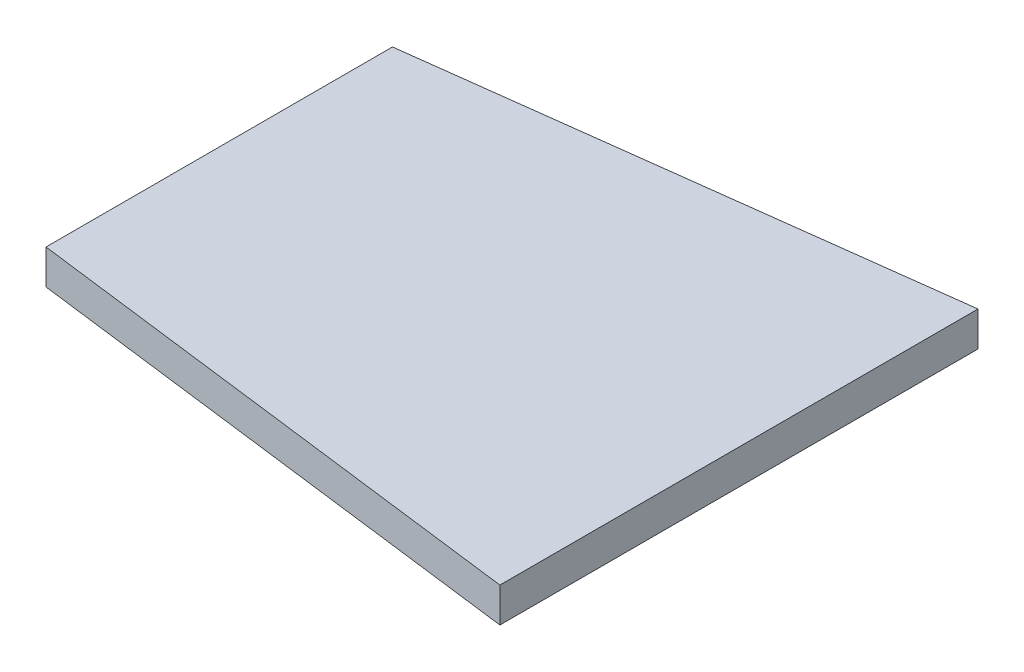
ISO-10303-21;
HEADER;
FILE_DESCRIPTION(('STEP AP214'),'2;1');
FILE_NAME('part.step','',(''),(''),'','','');
FILE_SCHEMA(('AUTOMOTIVE_DESIGN { 1 0 10303 214 1 1 1 1 }'));
ENDSEC;
DATA;
#1=APPLICATION_CONTEXT('core data for automotive mechanical design processes');
#2=APPLICATION_PROTOCOL_DEFINITION('international standard','automotive_design',2000,#1);
#3=PRODUCT_CONTEXT('',#1,'mechanical');
#4=PRODUCT('Part','Part','',(#3));
#5=PRODUCT_RELATED_PRODUCT_CATEGORY('part','',(#4));
#6=PRODUCT_DEFINITION_FORMATION('','',#4);
#7=PRODUCT_DEFINITION_CONTEXT('part definition',#1,'design');
#8=PRODUCT_DEFINITION('design','',#6,#7);
#9=PRODUCT_DEFINITION_SHAPE('','',#8);
#10=(LENGTH_UNIT() NAMED_UNIT(*) SI_UNIT(.MILLI.,.METRE.));
#11=(NAMED_UNIT(*) PLANE_ANGLE_UNIT() SI_UNIT($,.RADIAN.));
#12=(NAMED_UNIT(*) SI_UNIT($,.STERADIAN.) SOLID_ANGLE_UNIT());
#13=UNCERTAINTY_MEASURE_WITH_UNIT(LENGTH_MEASURE(1.E-05),#10,'distance_accuracy_value','');
#14=(GEOMETRIC_REPRESENTATION_CONTEXT(3) GLOBAL_UNCERTAINTY_ASSIGNED_CONTEXT((#13)) GLOBAL_UNIT_ASSIGNED_CONTEXT((#10,
#11,#12)) REPRESENTATION_CONTEXT('',''));
#15=CARTESIAN_POINT('',(0.,0.,0.));
#16=DIRECTION('',(0.,0.,1.));
#17=DIRECTION('',(1.,0.,0.));
#18=AXIS2_PLACEMENT_3D('',#15,#16,#17);
#19=CARTESIAN_POINT('',(0.,5.,25.));
#20=DIRECTION('',(0.12566258494223,0.,-0.99207303901761));
#21=DIRECTION('',(-0.99207303901761,0.,-0.12566258494223));
#22=AXIS2_PLACEMENT_3D('',#19,#20,#21);
#23=PLANE('',#22);
#24=DIRECTION('',(0.99207303901761,0.,0.12566258494223));
#25=VECTOR('',#24,1.);
#26=CARTESIAN_POINT('',(0.,0.,25.));
#27=LINE('',#26,#25);
#28=CARTESIAN_POINT('',(0.,0.,25.));
#29=VERTEX_POINT('',#28);
#30=CARTESIAN_POINT('',(75.,0.,34.5));
#31=VERTEX_POINT('',#30);
#32=EDGE_CURVE('E100',#29,#31,#27,.T.);
#33=ORIENTED_EDGE('',*,*,#32,.T.);
#34=DIRECTION('',(0.,-1.,0.));
#35=VECTOR('',#34,1.);
#36=CARTESIAN_POINT('',(75.,5.,34.5));
#37=LINE('',#36,#35);
#38=CARTESIAN_POINT('',(75.,5.,34.5));
#39=VERTEX_POINT('',#38);
#40=EDGE_CURVE('E11',#39,#31,#37,.T.);
#41=ORIENTED_EDGE('',*,*,#40,.F.);
#42=DIRECTION('',(0.99207303901761,0.,0.12566258494223));
#43=VECTOR('',#42,1.);
#44=CARTESIAN_POINT('',(0.,5.,25.));
#45=LINE('',#44,#43);
#46=CARTESIAN_POINT('',(0.,5.,25.));
#47=VERTEX_POINT('',#46);
#48=EDGE_CURVE('E88',#47,#39,#45,.T.);
#49=ORIENTED_EDGE('',*,*,#48,.F.);
#50=DIRECTION('',(0.,-1.,0.));
#51=VECTOR('',#50,1.);
#52=CARTESIAN_POINT('',(0.,5.,25.));
#53=LINE('',#52,#51);
#54=EDGE_CURVE('E96',#47,#29,#53,.T.);
#55=ORIENTED_EDGE('',*,*,#54,.T.);
#56=EDGE_LOOP('',(#33,#41,#49,#55));
#57=FACE_BOUND('',#56,.T.);
#58=ADVANCED_FACE('F37',(#57),#23,.F.);
#59=CARTESIAN_POINT('',(75.,5.,-34.5));
#60=DIRECTION('',(-1.,0.,0.));
#61=DIRECTION('',(0.,0.,1.));
#62=AXIS2_PLACEMENT_3D('',#59,#60,#61);
#63=PLANE('',#62);
#64=DIRECTION('',(0.,0.,-1.));
#65=VECTOR('',#64,1.);
#66=CARTESIAN_POINT('',(75.,0.,-34.5));
#67=LINE('',#66,#65);
#68=CARTESIAN_POINT('',(75.,0.,-34.5));
#69=VERTEX_POINT('',#68);
#70=EDGE_CURVE('E92',#31,#69,#67,.T.);
#71=ORIENTED_EDGE('',*,*,#70,.T.);
#72=DIRECTION('',(0.,-1.,0.));
#73=VECTOR('',#72,1.);
#74=CARTESIAN_POINT('',(75.,5.,-34.5));
#75=LINE('',#74,#73);
#76=CARTESIAN_POINT('',(75.,5.,-34.5));
#77=VERTEX_POINT('',#76);
#78=EDGE_CURVE('E45',#77,#69,#75,.T.);
#79=ORIENTED_EDGE('',*,*,#78,.F.);
#80=DIRECTION('',(0.,0.,-1.));
#81=VECTOR('',#80,1.);
#82=CARTESIAN_POINT('',(75.,5.,-34.5));
#83=LINE('',#82,#81);
#84=EDGE_CURVE('E83',#39,#77,#83,.T.);
#85=ORIENTED_EDGE('',*,*,#84,.F.);
#86=ORIENTED_EDGE('',*,*,#40,.T.);
#87=EDGE_LOOP('',(#71,#79,#85,#86));
#88=FACE_BOUND('',#87,.T.);
#89=ADVANCED_FACE('F91',(#88),#63,.F.);
#90=CARTESIAN_POINT('',(0.,5.,-25.));
#91=DIRECTION('',(0.125662584942231,0.,0.99207303901761));
#92=DIRECTION('',(0.99207303901761,0.,-0.125662584942231));
#93=AXIS2_PLACEMENT_3D('',#90,#91,#92);
#94=PLANE('',#93);
#95=DIRECTION('',(-0.99207303901761,0.,0.125662584942231));
#96=VECTOR('',#95,1.);
#97=CARTESIAN_POINT('',(0.,0.,-25.));
#98=LINE('',#97,#96);
#99=CARTESIAN_POINT('',(0.,0.,-25.));
#100=VERTEX_POINT('',#99);
#101=EDGE_CURVE('E70',#69,#100,#98,.T.);
#102=ORIENTED_EDGE('',*,*,#101,.T.);
#103=DIRECTION('',(0.,-1.,0.));
#104=VECTOR('',#103,1.);
#105=CARTESIAN_POINT('',(0.,5.,-25.));
#106=LINE('',#105,#104);
#107=CARTESIAN_POINT('',(0.,5.,-25.));
#108=VERTEX_POINT('',#107);
#109=EDGE_CURVE('E93',#108,#100,#106,.T.);
#110=ORIENTED_EDGE('',*,*,#109,.F.);
#111=DIRECTION('',(-0.99207303901761,0.,0.125662584942231));
#112=VECTOR('',#111,1.);
#113=CARTESIAN_POINT('',(0.,5.,-25.));
#114=LINE('',#113,#112);
#115=EDGE_CURVE('E86',#77,#108,#114,.T.);
#116=ORIENTED_EDGE('',*,*,#115,.F.);
#117=ORIENTED_EDGE('',*,*,#78,.T.);
#118=EDGE_LOOP('',(#102,#110,#116,#117));
#119=FACE_BOUND('',#118,.T.);
#120=ADVANCED_FACE('F94',(#119),#94,.F.);
#121=CARTESIAN_POINT('',(0.,5.,25.));
#122=DIRECTION('',(1.,0.,0.));
#123=DIRECTION('',(0.,0.,-1.));
#124=AXIS2_PLACEMENT_3D('',#121,#122,#123);
#125=PLANE('',#124);
#126=DIRECTION('',(0.,0.,1.));
#127=VECTOR('',#126,1.);
#128=CARTESIAN_POINT('',(0.,0.,25.));
#129=LINE('',#128,#127);
#130=EDGE_CURVE('E76',#100,#29,#129,.T.);
#131=ORIENTED_EDGE('',*,*,#130,.T.);
#132=ORIENTED_EDGE('',*,*,#54,.F.);
#133=DIRECTION('',(0.,0.,1.));
#134=VECTOR('',#133,1.);
#135=CARTESIAN_POINT('',(0.,5.,25.));
#136=LINE('',#135,#134);
#137=EDGE_CURVE('E53',#108,#47,#136,.T.);
#138=ORIENTED_EDGE('',*,*,#137,.F.);
#139=ORIENTED_EDGE('',*,*,#109,.T.);
#140=EDGE_LOOP('',(#131,#132,#138,#139));
#141=FACE_BOUND('',#140,.T.);
#142=ADVANCED_FACE('F107',(#141),#125,.F.);
#143=CARTESIAN_POINT('',(0.,5.,0.));
#144=DIRECTION('',(0.,-1.,0.));
#145=DIRECTION('',(0.,0.,-1.));
#146=AXIS2_PLACEMENT_3D('',#143,#144,#145);
#147=PLANE('',#146);
#148=ORIENTED_EDGE('',*,*,#48,.T.);
#149=ORIENTED_EDGE('',*,*,#84,.T.);
#150=ORIENTED_EDGE('',*,*,#115,.T.);
#151=ORIENTED_EDGE('',*,*,#137,.T.);
#152=EDGE_LOOP('',(#148,#149,#150,#151));
#153=FACE_BOUND('',#152,.T.);
#154=ADVANCED_FACE('F84',(#153),#147,.F.);
#155=CARTESIAN_POINT('',(0.,0.,0.));
#156=DIRECTION('',(0.,-1.,0.));
#157=DIRECTION('',(0.,0.,-1.));
#158=AXIS2_PLACEMENT_3D('',#155,#156,#157);
#159=PLANE('',#158);
#160=ORIENTED_EDGE('',*,*,#32,.F.);
#161=ORIENTED_EDGE('',*,*,#130,.F.);
#162=ORIENTED_EDGE('',*,*,#101,.F.);
#163=ORIENTED_EDGE('',*,*,#70,.F.);
#164=EDGE_LOOP('',(#160,#161,#162,#163));
#165=FACE_BOUND('',#164,.T.);
#166=ADVANCED_FACE('F110',(#165),#159,.T.);
#167=CLOSED_SHELL('',(#58,#89,#120,#142,#154,#166));
#168=MANIFOLD_SOLID_BREP('B2',#167);
#169=ADVANCED_BREP_SHAPE_REPRESENTATION('',(#18,#168),#14);
#170=SHAPE_DEFINITION_REPRESENTATION(#9,#169);
ENDSEC;
END-ISO-10303-21;
